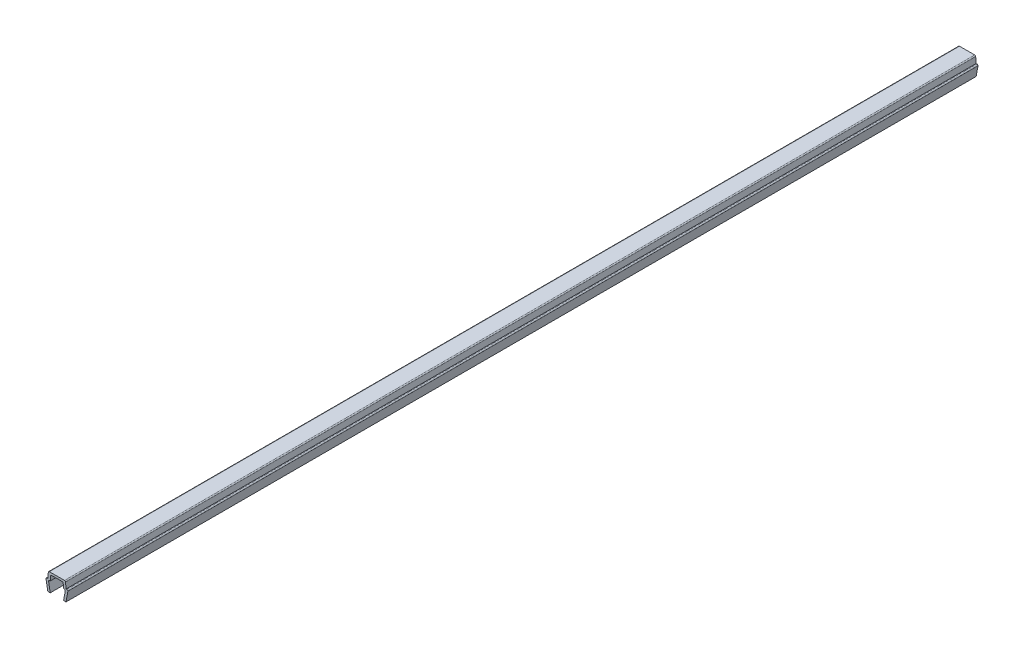
ISO-10303-21;
HEADER;
FILE_DESCRIPTION(('STEP AP214'),'2;1');
FILE_NAME('part.step','',(''),(''),'','','');
FILE_SCHEMA(('AUTOMOTIVE_DESIGN { 1 0 10303 214 1 1 1 1 }'));
ENDSEC;
DATA;
#1=APPLICATION_CONTEXT('core data for automotive mechanical design processes');
#2=APPLICATION_PROTOCOL_DEFINITION('international standard','automotive_design',2000,#1);
#3=PRODUCT_CONTEXT('',#1,'mechanical');
#4=PRODUCT('Part','Part','',(#3));
#5=PRODUCT_RELATED_PRODUCT_CATEGORY('part','',(#4));
#6=PRODUCT_DEFINITION_FORMATION('','',#4);
#7=PRODUCT_DEFINITION_CONTEXT('part definition',#1,'design');
#8=PRODUCT_DEFINITION('design','',#6,#7);
#9=PRODUCT_DEFINITION_SHAPE('','',#8);
#10=(LENGTH_UNIT() NAMED_UNIT(*) SI_UNIT(.MILLI.,.METRE.));
#11=(NAMED_UNIT(*) PLANE_ANGLE_UNIT() SI_UNIT($,.RADIAN.));
#12=(NAMED_UNIT(*) SI_UNIT($,.STERADIAN.) SOLID_ANGLE_UNIT());
#13=UNCERTAINTY_MEASURE_WITH_UNIT(LENGTH_MEASURE(1.E-05),#10,'distance_accuracy_value','');
#14=(GEOMETRIC_REPRESENTATION_CONTEXT(3) GLOBAL_UNCERTAINTY_ASSIGNED_CONTEXT((#13)) GLOBAL_UNIT_ASSIGNED_CONTEXT((#10,
#11,#12)) REPRESENTATION_CONTEXT('',''));
#15=CARTESIAN_POINT('',(0.,0.,0.));
#16=DIRECTION('',(0.,0.,1.));
#17=DIRECTION('',(1.,0.,0.));
#18=AXIS2_PLACEMENT_3D('',#15,#16,#17);
#19=CARTESIAN_POINT('',(-3.25000000000003,3.35000000000003,150.));
#20=DIRECTION('',(0.,0.,-1.));
#21=DIRECTION('',(-1.,0.,0.));
#22=AXIS2_PLACEMENT_3D('',#19,#20,#21);
#23=CYLINDRICAL_SURFACE('',#22,0.349999999999972);
#24=DIRECTION('',(0.,0.,-1.));
#25=VECTOR('',#24,1.);
#26=CARTESIAN_POINT('',(-3.25,3.7,150.));
#27=LINE('',#26,#25);
#28=CARTESIAN_POINT('',(-3.25,3.7,150.));
#29=VERTEX_POINT('',#28);
#30=CARTESIAN_POINT('',(-3.25,3.7,-150.));
#31=VERTEX_POINT('',#30);
#32=EDGE_CURVE('E211',#29,#31,#27,.T.);
#33=ORIENTED_EDGE('',*,*,#32,.T.);
#34=CARTESIAN_POINT('',(-3.25000000000003,3.35000000000003,-150.));
#35=DIRECTION('',(0.,0.,1.));
#36=DIRECTION('',(1.,0.,0.));
#37=AXIS2_PLACEMENT_3D('',#34,#35,#36);
#38=CIRCLE('',#37,0.349999999999972);
#39=CARTESIAN_POINT('',(-3.6,3.35,-150.));
#40=VERTEX_POINT('',#39);
#41=EDGE_CURVE('E205',#31,#40,#38,.T.);
#42=ORIENTED_EDGE('',*,*,#41,.T.);
#43=DIRECTION('',(0.,0.,-1.));
#44=VECTOR('',#43,1.);
#45=CARTESIAN_POINT('',(-3.6,3.35,150.));
#46=LINE('',#45,#44);
#47=CARTESIAN_POINT('',(-3.6,3.35,150.));
#48=VERTEX_POINT('',#47);
#49=EDGE_CURVE('E11',#48,#40,#46,.T.);
#50=ORIENTED_EDGE('',*,*,#49,.F.);
#51=CARTESIAN_POINT('',(-3.25000000000003,3.35000000000003,150.));
#52=DIRECTION('',(0.,0.,1.));
#53=DIRECTION('',(1.,0.,0.));
#54=AXIS2_PLACEMENT_3D('',#51,#52,#53);
#55=CIRCLE('',#54,0.349999999999972);
#56=EDGE_CURVE('E277',#29,#48,#55,.T.);
#57=ORIENTED_EDGE('',*,*,#56,.F.);
#58=EDGE_LOOP('',(#33,#42,#50,#57));
#59=FACE_BOUND('',#58,.T.);
#60=ADVANCED_FACE('F33',(#59),#23,.T.);
#61=CARTESIAN_POINT('',(-3.6,3.35,150.));
#62=DIRECTION('',(0.984336643247304,0.176299100283099,0.));
#63=DIRECTION('',(-0.176299100283099,0.984336643247304,0.));
#64=AXIS2_PLACEMENT_3D('',#61,#62,#63);
#65=PLANE('',#64);
#66=ORIENTED_EDGE('',*,*,#49,.T.);
#67=DIRECTION('',(0.176299100283099,-0.984336643247304,0.));
#68=VECTOR('',#67,1.);
#69=CARTESIAN_POINT('',(-3.6,3.35,-150.));
#70=LINE('',#69,#68);
#71=CARTESIAN_POINT('',(-3.,0.,-150.));
#72=VERTEX_POINT('',#71);
#73=EDGE_CURVE('E195',#40,#72,#70,.T.);
#74=ORIENTED_EDGE('',*,*,#73,.T.);
#75=DIRECTION('',(0.,0.,-1.));
#76=VECTOR('',#75,1.);
#77=CARTESIAN_POINT('',(-3.,0.,150.));
#78=LINE('',#77,#76);
#79=CARTESIAN_POINT('',(-3.,0.,150.));
#80=VERTEX_POINT('',#79);
#81=EDGE_CURVE('E40',#80,#72,#78,.T.);
#82=ORIENTED_EDGE('',*,*,#81,.F.);
#83=DIRECTION('',(0.176299100283099,-0.984336643247304,0.));
#84=VECTOR('',#83,1.);
#85=CARTESIAN_POINT('',(-3.6,3.35,150.));
#86=LINE('',#85,#84);
#87=EDGE_CURVE('E196',#48,#80,#86,.T.);
#88=ORIENTED_EDGE('',*,*,#87,.F.);
#89=EDGE_LOOP('',(#66,#74,#82,#88));
#90=FACE_BOUND('',#89,.T.);
#91=ADVANCED_FACE('F193',(#90),#65,.F.);
#92=CARTESIAN_POINT('',(-3.,0.,150.));
#93=DIRECTION('',(0.,1.,0.));
#94=DIRECTION('',(0.,0.,1.));
#95=AXIS2_PLACEMENT_3D('',#92,#93,#94);
#96=PLANE('',#95);
#97=ORIENTED_EDGE('',*,*,#81,.T.);
#98=DIRECTION('',(1.,0.,0.));
#99=VECTOR('',#98,1.);
#100=CARTESIAN_POINT('',(-3.,0.,-150.));
#101=LINE('',#100,#99);
#102=CARTESIAN_POINT('',(-2.2,0.,-150.));
#103=VERTEX_POINT('',#102);
#104=EDGE_CURVE('E209',#72,#103,#101,.T.);
#105=ORIENTED_EDGE('',*,*,#104,.T.);
#106=DIRECTION('',(0.,0.,-1.));
#107=VECTOR('',#106,1.);
#108=CARTESIAN_POINT('',(-2.2,0.,150.));
#109=LINE('',#108,#107);
#110=CARTESIAN_POINT('',(-2.2,0.,150.));
#111=VERTEX_POINT('',#110);
#112=EDGE_CURVE('E363',#111,#103,#109,.T.);
#113=ORIENTED_EDGE('',*,*,#112,.F.);
#114=DIRECTION('',(1.,0.,0.));
#115=VECTOR('',#114,1.);
#116=CARTESIAN_POINT('',(-3.,0.,150.));
#117=LINE('',#116,#115);
#118=EDGE_CURVE('E280',#80,#111,#117,.T.);
#119=ORIENTED_EDGE('',*,*,#118,.F.);
#120=EDGE_LOOP('',(#97,#105,#113,#119));
#121=FACE_BOUND('',#120,.T.);
#122=ADVANCED_FACE('F366',(#121),#96,.F.);
#123=CARTESIAN_POINT('',(-2.2,0.,150.));
#124=DIRECTION('',(-0.984336643247306,-0.176299100283088,0.));
#125=DIRECTION('',(0.176299100283088,-0.984336643247306,0.));
#126=AXIS2_PLACEMENT_3D('',#123,#124,#125);
#127=PLANE('',#126);
#128=ORIENTED_EDGE('',*,*,#112,.T.);
#129=DIRECTION('',(-0.176299100283088,0.984336643247306,0.));
#130=VECTOR('',#129,1.);
#131=CARTESIAN_POINT('',(-2.2,0.,-150.));
#132=LINE('',#131,#130);
#133=CARTESIAN_POINT('',(-2.7352170713255,2.9882953149009,-150.));
#134=VERTEX_POINT('',#133);
#135=EDGE_CURVE('E215',#103,#134,#132,.T.);
#136=ORIENTED_EDGE('',*,*,#135,.T.);
#137=DIRECTION('',(0.,0.,-1.));
#138=VECTOR('',#137,1.);
#139=CARTESIAN_POINT('',(-2.7352170713255,2.9882953149009,150.));
#140=LINE('',#139,#138);
#141=CARTESIAN_POINT('',(-2.7352170713255,2.9882953149009,150.));
#142=VERTEX_POINT('',#141);
#143=EDGE_CURVE('E361',#142,#134,#140,.T.);
#144=ORIENTED_EDGE('',*,*,#143,.F.);
#145=DIRECTION('',(-0.176299100283088,0.984336643247306,0.));
#146=VECTOR('',#145,1.);
#147=CARTESIAN_POINT('',(-2.2,0.,150.));
#148=LINE('',#147,#146);
#149=EDGE_CURVE('E282',#111,#142,#148,.T.);
#150=ORIENTED_EDGE('',*,*,#149,.F.);
#151=EDGE_LOOP('',(#128,#136,#144,#150));
#152=FACE_BOUND('',#151,.T.);
#153=ADVANCED_FACE('F374',(#152),#127,.F.);
#154=CARTESIAN_POINT('',(-2.390699246189,3.05000000000004,150.));
#155=DIRECTION('',(0.,0.,-1.));
#156=DIRECTION('',(-1.,0.,0.));
#157=AXIS2_PLACEMENT_3D('',#154,#155,#156);
#158=CYLINDRICAL_SURFACE('',#157,0.349999999999955);
#159=ORIENTED_EDGE('',*,*,#143,.T.);
#160=CARTESIAN_POINT('',(-2.390699246189,3.05000000000004,-150.));
#161=DIRECTION('',(0.,0.,-1.));
#162=DIRECTION('',(-1.,0.,0.));
#163=AXIS2_PLACEMENT_3D('',#160,#161,#162);
#164=CIRCLE('',#163,0.349999999999955);
#165=CARTESIAN_POINT('',(-2.390699246189,3.4,-150.));
#166=VERTEX_POINT('',#165);
#167=EDGE_CURVE('E218',#134,#166,#164,.T.);
#168=ORIENTED_EDGE('',*,*,#167,.T.);
#169=DIRECTION('',(0.,0.,-1.));
#170=VECTOR('',#169,1.);
#171=CARTESIAN_POINT('',(-2.390699246189,3.4,150.));
#172=LINE('',#171,#170);
#173=CARTESIAN_POINT('',(-2.390699246189,3.4,150.));
#174=VERTEX_POINT('',#173);
#175=EDGE_CURVE('E359',#174,#166,#172,.T.);
#176=ORIENTED_EDGE('',*,*,#175,.F.);
#177=CARTESIAN_POINT('',(-2.390699246189,3.05000000000004,150.));
#178=DIRECTION('',(0.,0.,-1.));
#179=DIRECTION('',(-1.,0.,0.));
#180=AXIS2_PLACEMENT_3D('',#177,#178,#179);
#181=CIRCLE('',#180,0.349999999999955);
#182=EDGE_CURVE('E284',#142,#174,#181,.T.);
#183=ORIENTED_EDGE('',*,*,#182,.F.);
#184=EDGE_LOOP('',(#159,#168,#176,#183));
#185=FACE_BOUND('',#184,.T.);
#186=ADVANCED_FACE('F377',(#185),#158,.F.);
#187=CARTESIAN_POINT('',(-2.390699246189,3.4,150.));
#188=DIRECTION('',(0.,1.,0.));
#189=DIRECTION('',(0.,0.,1.));
#190=AXIS2_PLACEMENT_3D('',#187,#188,#189);
#191=PLANE('',#190);
#192=ORIENTED_EDGE('',*,*,#175,.T.);
#193=DIRECTION('',(1.,0.,0.));
#194=VECTOR('',#193,1.);
#195=CARTESIAN_POINT('',(-2.390699246189,3.4,-150.));
#196=LINE('',#195,#194);
#197=CARTESIAN_POINT('',(-2.2,3.4,-150.));
#198=VERTEX_POINT('',#197);
#199=EDGE_CURVE('E221',#166,#198,#196,.T.);
#200=ORIENTED_EDGE('',*,*,#199,.T.);
#201=DIRECTION('',(0.,0.,-1.));
#202=VECTOR('',#201,1.);
#203=CARTESIAN_POINT('',(-2.2,3.4,150.));
#204=LINE('',#203,#202);
#205=CARTESIAN_POINT('',(-2.2,3.4,150.));
#206=VERTEX_POINT('',#205);
#207=EDGE_CURVE('E357',#206,#198,#204,.T.);
#208=ORIENTED_EDGE('',*,*,#207,.F.);
#209=DIRECTION('',(1.,0.,0.));
#210=VECTOR('',#209,1.);
#211=CARTESIAN_POINT('',(-2.390699246189,3.4,150.));
#212=LINE('',#211,#210);
#213=EDGE_CURVE('E286',#174,#206,#212,.T.);
#214=ORIENTED_EDGE('',*,*,#213,.F.);
#215=EDGE_LOOP('',(#192,#200,#208,#214));
#216=FACE_BOUND('',#215,.T.);
#217=ADVANCED_FACE('F382',(#216),#191,.F.);
#218=CARTESIAN_POINT('',(-2.2,3.4,150.));
#219=DIRECTION('',(-0.996194698091743,0.08715574274769,0.));
#220=DIRECTION('',(-0.08715574274769,-0.996194698091743,0.));
#221=AXIS2_PLACEMENT_3D('',#218,#219,#220);
#222=PLANE('',#221);
#223=ORIENTED_EDGE('',*,*,#207,.T.);
#224=DIRECTION('',(0.08715574274769,0.996194698091743,0.));
#225=VECTOR('',#224,1.);
#226=CARTESIAN_POINT('',(-2.2,3.4,-150.));
#227=LINE('',#226,#225);
#228=CARTESIAN_POINT('',(-2.0704726390793,4.8805045099617,-150.));
#229=VERTEX_POINT('',#228);
#230=EDGE_CURVE('E224',#198,#229,#227,.T.);
#231=ORIENTED_EDGE('',*,*,#230,.T.);
#232=DIRECTION('',(0.,0.,-1.));
#233=VECTOR('',#232,1.);
#234=CARTESIAN_POINT('',(-2.0704726390793,4.8805045099617,150.));
#235=LINE('',#234,#233);
#236=CARTESIAN_POINT('',(-2.0704726390793,4.8805045099617,150.));
#237=VERTEX_POINT('',#236);
#238=EDGE_CURVE('E355',#237,#229,#235,.T.);
#239=ORIENTED_EDGE('',*,*,#238,.F.);
#240=DIRECTION('',(0.08715574274769,0.996194698091743,0.));
#241=VECTOR('',#240,1.);
#242=CARTESIAN_POINT('',(-2.2,3.4,150.));
#243=LINE('',#242,#241);
#244=EDGE_CURVE('E288',#206,#237,#243,.T.);
#245=ORIENTED_EDGE('',*,*,#244,.F.);
#246=EDGE_LOOP('',(#223,#231,#239,#245));
#247=FACE_BOUND('',#246,.T.);
#248=ADVANCED_FACE('F388',(#247),#222,.F.);
#249=CARTESIAN_POINT('',(-1.72180449474716,4.84999999999996,150.));
#250=DIRECTION('',(0.,0.,-1.));
#251=DIRECTION('',(-1.,0.,0.));
#252=AXIS2_PLACEMENT_3D('',#249,#250,#251);
#253=CYLINDRICAL_SURFACE('',#252,0.350000000000036);
#254=ORIENTED_EDGE('',*,*,#238,.T.);
#255=CARTESIAN_POINT('',(-1.72180449474716,4.84999999999996,-150.));
#256=DIRECTION('',(0.,0.,-1.));
#257=DIRECTION('',(-1.,0.,0.));
#258=AXIS2_PLACEMENT_3D('',#255,#256,#257);
#259=CIRCLE('',#258,0.350000000000036);
#260=CARTESIAN_POINT('',(-1.7218044947472,5.2,-150.));
#261=VERTEX_POINT('',#260);
#262=EDGE_CURVE('E227',#229,#261,#259,.T.);
#263=ORIENTED_EDGE('',*,*,#262,.T.);
#264=DIRECTION('',(0.,0.,-1.));
#265=VECTOR('',#264,1.);
#266=CARTESIAN_POINT('',(-1.7218044947472,5.2,150.));
#267=LINE('',#266,#265);
#268=CARTESIAN_POINT('',(-1.7218044947472,5.2,150.));
#269=VERTEX_POINT('',#268);
#270=EDGE_CURVE('E353',#269,#261,#267,.T.);
#271=ORIENTED_EDGE('',*,*,#270,.F.);
#272=CARTESIAN_POINT('',(-1.72180449474716,4.84999999999996,150.));
#273=DIRECTION('',(0.,0.,-1.));
#274=DIRECTION('',(-1.,0.,0.));
#275=AXIS2_PLACEMENT_3D('',#272,#273,#274);
#276=CIRCLE('',#275,0.350000000000036);
#277=EDGE_CURVE('E290',#237,#269,#276,.T.);
#278=ORIENTED_EDGE('',*,*,#277,.F.);
#279=EDGE_LOOP('',(#254,#263,#271,#278));
#280=FACE_BOUND('',#279,.T.);
#281=ADVANCED_FACE('F392',(#280),#253,.F.);
#282=CARTESIAN_POINT('',(-1.7218044947472,5.2,150.));
#283=DIRECTION('',(0.,1.,0.));
#284=DIRECTION('',(0.,0.,1.));
#285=AXIS2_PLACEMENT_3D('',#282,#283,#284);
#286=PLANE('',#285);
#287=ORIENTED_EDGE('',*,*,#270,.T.);
#288=DIRECTION('',(1.,0.,0.));
#289=VECTOR('',#288,1.);
#290=CARTESIAN_POINT('',(-1.7218044947472,5.2,-150.));
#291=LINE('',#290,#289);
#292=CARTESIAN_POINT('',(1.7218044947472,5.2,-150.));
#293=VERTEX_POINT('',#292);
#294=EDGE_CURVE('E230',#261,#293,#291,.T.);
#295=ORIENTED_EDGE('',*,*,#294,.T.);
#296=DIRECTION('',(0.,0.,-1.));
#297=VECTOR('',#296,1.);
#298=CARTESIAN_POINT('',(1.7218044947472,5.2,150.));
#299=LINE('',#298,#297);
#300=CARTESIAN_POINT('',(1.7218044947472,5.2,150.));
#301=VERTEX_POINT('',#300);
#302=EDGE_CURVE('E351',#301,#293,#299,.T.);
#303=ORIENTED_EDGE('',*,*,#302,.F.);
#304=DIRECTION('',(1.,0.,0.));
#305=VECTOR('',#304,1.);
#306=CARTESIAN_POINT('',(-1.7218044947472,5.2,150.));
#307=LINE('',#306,#305);
#308=EDGE_CURVE('E292',#269,#301,#307,.T.);
#309=ORIENTED_EDGE('',*,*,#308,.F.);
#310=EDGE_LOOP('',(#287,#295,#303,#309));
#311=FACE_BOUND('',#310,.T.);
#312=ADVANCED_FACE('F397',(#311),#286,.F.);
#313=CARTESIAN_POINT('',(1.72180449474716,4.84999999999996,150.));
#314=DIRECTION('',(0.,0.,-1.));
#315=DIRECTION('',(-1.,0.,0.));
#316=AXIS2_PLACEMENT_3D('',#313,#314,#315);
#317=CYLINDRICAL_SURFACE('',#316,0.350000000000036);
#318=ORIENTED_EDGE('',*,*,#302,.T.);
#319=CARTESIAN_POINT('',(1.72180449474716,4.84999999999996,-150.));
#320=DIRECTION('',(0.,0.,-1.));
#321=DIRECTION('',(-1.,0.,0.));
#322=AXIS2_PLACEMENT_3D('',#319,#320,#321);
#323=CIRCLE('',#322,0.350000000000036);
#324=CARTESIAN_POINT('',(2.0704726390793,4.8805045099617,-150.));
#325=VERTEX_POINT('',#324);
#326=EDGE_CURVE('E233',#293,#325,#323,.T.);
#327=ORIENTED_EDGE('',*,*,#326,.T.);
#328=DIRECTION('',(0.,0.,-1.));
#329=VECTOR('',#328,1.);
#330=CARTESIAN_POINT('',(2.0704726390793,4.8805045099617,150.));
#331=LINE('',#330,#329);
#332=CARTESIAN_POINT('',(2.0704726390793,4.8805045099617,150.));
#333=VERTEX_POINT('',#332);
#334=EDGE_CURVE('E349',#333,#325,#331,.T.);
#335=ORIENTED_EDGE('',*,*,#334,.F.);
#336=CARTESIAN_POINT('',(1.72180449474716,4.84999999999996,150.));
#337=DIRECTION('',(0.,0.,-1.));
#338=DIRECTION('',(-1.,0.,0.));
#339=AXIS2_PLACEMENT_3D('',#336,#337,#338);
#340=CIRCLE('',#339,0.350000000000036);
#341=EDGE_CURVE('E294',#301,#333,#340,.T.);
#342=ORIENTED_EDGE('',*,*,#341,.F.);
#343=EDGE_LOOP('',(#318,#327,#335,#342));
#344=FACE_BOUND('',#343,.T.);
#345=ADVANCED_FACE('F403',(#344),#317,.F.);
#346=CARTESIAN_POINT('',(2.0704726390793,4.8805045099617,150.));
#347=DIRECTION('',(0.996194698091743,0.08715574274769,0.));
#348=DIRECTION('',(-0.08715574274769,0.996194698091743,0.));
#349=AXIS2_PLACEMENT_3D('',#346,#347,#348);
#350=PLANE('',#349);
#351=ORIENTED_EDGE('',*,*,#334,.T.);
#352=DIRECTION('',(0.08715574274769,-0.996194698091743,0.));
#353=VECTOR('',#352,1.);
#354=CARTESIAN_POINT('',(2.0704726390793,4.8805045099617,-150.));
#355=LINE('',#354,#353);
#356=CARTESIAN_POINT('',(2.2,3.4,-150.));
#357=VERTEX_POINT('',#356);
#358=EDGE_CURVE('E236',#325,#357,#355,.T.);
#359=ORIENTED_EDGE('',*,*,#358,.T.);
#360=DIRECTION('',(0.,0.,-1.));
#361=VECTOR('',#360,1.);
#362=CARTESIAN_POINT('',(2.2,3.4,150.));
#363=LINE('',#362,#361);
#364=CARTESIAN_POINT('',(2.2,3.4,150.));
#365=VERTEX_POINT('',#364);
#366=EDGE_CURVE('E347',#365,#357,#363,.T.);
#367=ORIENTED_EDGE('',*,*,#366,.F.);
#368=DIRECTION('',(0.08715574274769,-0.996194698091743,0.));
#369=VECTOR('',#368,1.);
#370=CARTESIAN_POINT('',(2.0704726390793,4.8805045099617,150.));
#371=LINE('',#370,#369);
#372=EDGE_CURVE('E296',#333,#365,#371,.T.);
#373=ORIENTED_EDGE('',*,*,#372,.F.);
#374=EDGE_LOOP('',(#351,#359,#367,#373));
#375=FACE_BOUND('',#374,.T.);
#376=ADVANCED_FACE('F407',(#375),#350,.F.);
#377=CARTESIAN_POINT('',(2.2,3.4,150.));
#378=DIRECTION('',(0.,1.,0.));
#379=DIRECTION('',(0.,0.,1.));
#380=AXIS2_PLACEMENT_3D('',#377,#378,#379);
#381=PLANE('',#380);
#382=ORIENTED_EDGE('',*,*,#366,.T.);
#383=DIRECTION('',(1.,0.,0.));
#384=VECTOR('',#383,1.);
#385=CARTESIAN_POINT('',(2.2,3.4,-150.));
#386=LINE('',#385,#384);
#387=CARTESIAN_POINT('',(2.390699246189,3.4,-150.));
#388=VERTEX_POINT('',#387);
#389=EDGE_CURVE('E239',#357,#388,#386,.T.);
#390=ORIENTED_EDGE('',*,*,#389,.T.);
#391=DIRECTION('',(0.,0.,-1.));
#392=VECTOR('',#391,1.);
#393=CARTESIAN_POINT('',(2.390699246189,3.4,150.));
#394=LINE('',#393,#392);
#395=CARTESIAN_POINT('',(2.390699246189,3.4,150.));
#396=VERTEX_POINT('',#395);
#397=EDGE_CURVE('E345',#396,#388,#394,.T.);
#398=ORIENTED_EDGE('',*,*,#397,.F.);
#399=DIRECTION('',(1.,0.,0.));
#400=VECTOR('',#399,1.);
#401=CARTESIAN_POINT('',(2.2,3.4,150.));
#402=LINE('',#401,#400);
#403=EDGE_CURVE('E298',#365,#396,#402,.T.);
#404=ORIENTED_EDGE('',*,*,#403,.F.);
#405=EDGE_LOOP('',(#382,#390,#398,#404));
#406=FACE_BOUND('',#405,.T.);
#407=ADVANCED_FACE('F412',(#406),#381,.F.);
#408=CARTESIAN_POINT('',(2.390699246189,3.05000000000004,150.));
#409=DIRECTION('',(0.,0.,-1.));
#410=DIRECTION('',(-1.,0.,0.));
#411=AXIS2_PLACEMENT_3D('',#408,#409,#410);
#412=CYLINDRICAL_SURFACE('',#411,0.349999999999955);
#413=ORIENTED_EDGE('',*,*,#397,.T.);
#414=CARTESIAN_POINT('',(2.390699246189,3.05000000000004,-150.));
#415=DIRECTION('',(0.,0.,-1.));
#416=DIRECTION('',(-1.,0.,0.));
#417=AXIS2_PLACEMENT_3D('',#414,#415,#416);
#418=CIRCLE('',#417,0.349999999999955);
#419=CARTESIAN_POINT('',(2.7352170713255,2.9882953149009,-150.));
#420=VERTEX_POINT('',#419);
#421=EDGE_CURVE('E242',#388,#420,#418,.T.);
#422=ORIENTED_EDGE('',*,*,#421,.T.);
#423=DIRECTION('',(0.,0.,-1.));
#424=VECTOR('',#423,1.);
#425=CARTESIAN_POINT('',(2.7352170713255,2.9882953149009,150.));
#426=LINE('',#425,#424);
#427=CARTESIAN_POINT('',(2.7352170713255,2.9882953149009,150.));
#428=VERTEX_POINT('',#427);
#429=EDGE_CURVE('E343',#428,#420,#426,.T.);
#430=ORIENTED_EDGE('',*,*,#429,.F.);
#431=CARTESIAN_POINT('',(2.390699246189,3.05000000000004,150.));
#432=DIRECTION('',(0.,0.,-1.));
#433=DIRECTION('',(-1.,0.,0.));
#434=AXIS2_PLACEMENT_3D('',#431,#432,#433);
#435=CIRCLE('',#434,0.349999999999955);
#436=EDGE_CURVE('E300',#396,#428,#435,.T.);
#437=ORIENTED_EDGE('',*,*,#436,.F.);
#438=EDGE_LOOP('',(#413,#422,#430,#437));
#439=FACE_BOUND('',#438,.T.);
#440=ADVANCED_FACE('F418',(#439),#412,.F.);
#441=CARTESIAN_POINT('',(2.7352170713255,2.9882953149009,150.));
#442=DIRECTION('',(0.984336643247306,-0.176299100283088,0.));
#443=DIRECTION('',(0.176299100283088,0.984336643247306,0.));
#444=AXIS2_PLACEMENT_3D('',#441,#442,#443);
#445=PLANE('',#444);
#446=ORIENTED_EDGE('',*,*,#429,.T.);
#447=DIRECTION('',(-0.176299100283088,-0.984336643247306,0.));
#448=VECTOR('',#447,1.);
#449=CARTESIAN_POINT('',(2.7352170713255,2.9882953149009,-150.));
#450=LINE('',#449,#448);
#451=CARTESIAN_POINT('',(2.2,0.,-150.));
#452=VERTEX_POINT('',#451);
#453=EDGE_CURVE('E245',#420,#452,#450,.T.);
#454=ORIENTED_EDGE('',*,*,#453,.T.);
#455=DIRECTION('',(0.,0.,-1.));
#456=VECTOR('',#455,1.);
#457=CARTESIAN_POINT('',(2.2,0.,150.));
#458=LINE('',#457,#456);
#459=CARTESIAN_POINT('',(2.2,0.,150.));
#460=VERTEX_POINT('',#459);
#461=EDGE_CURVE('E341',#460,#452,#458,.T.);
#462=ORIENTED_EDGE('',*,*,#461,.F.);
#463=DIRECTION('',(-0.176299100283088,-0.984336643247306,0.));
#464=VECTOR('',#463,1.);
#465=CARTESIAN_POINT('',(2.7352170713255,2.9882953149009,150.));
#466=LINE('',#465,#464);
#467=EDGE_CURVE('E302',#428,#460,#466,.T.);
#468=ORIENTED_EDGE('',*,*,#467,.F.);
#469=EDGE_LOOP('',(#446,#454,#462,#468));
#470=FACE_BOUND('',#469,.T.);
#471=ADVANCED_FACE('F422',(#470),#445,.F.);
#472=CARTESIAN_POINT('',(2.2,0.,150.));
#473=DIRECTION('',(0.,1.,0.));
#474=DIRECTION('',(0.,0.,1.));
#475=AXIS2_PLACEMENT_3D('',#472,#473,#474);
#476=PLANE('',#475);
#477=ORIENTED_EDGE('',*,*,#461,.T.);
#478=DIRECTION('',(1.,0.,0.));
#479=VECTOR('',#478,1.);
#480=CARTESIAN_POINT('',(2.2,0.,-150.));
#481=LINE('',#480,#479);
#482=CARTESIAN_POINT('',(3.,0.,-150.));
#483=VERTEX_POINT('',#482);
#484=EDGE_CURVE('E248',#452,#483,#481,.T.);
#485=ORIENTED_EDGE('',*,*,#484,.T.);
#486=DIRECTION('',(0.,0.,-1.));
#487=VECTOR('',#486,1.);
#488=CARTESIAN_POINT('',(3.,0.,150.));
#489=LINE('',#488,#487);
#490=CARTESIAN_POINT('',(3.,0.,150.));
#491=VERTEX_POINT('',#490);
#492=EDGE_CURVE('E339',#491,#483,#489,.T.);
#493=ORIENTED_EDGE('',*,*,#492,.F.);
#494=DIRECTION('',(1.,0.,0.));
#495=VECTOR('',#494,1.);
#496=CARTESIAN_POINT('',(2.2,0.,150.));
#497=LINE('',#496,#495);
#498=EDGE_CURVE('E304',#460,#491,#497,.T.);
#499=ORIENTED_EDGE('',*,*,#498,.F.);
#500=EDGE_LOOP('',(#477,#485,#493,#499));
#501=FACE_BOUND('',#500,.T.);
#502=ADVANCED_FACE('F427',(#501),#476,.F.);
#503=CARTESIAN_POINT('',(3.,0.,150.));
#504=DIRECTION('',(-0.984336643247304,0.176299100283099,0.));
#505=DIRECTION('',(-0.176299100283099,-0.984336643247304,0.));
#506=AXIS2_PLACEMENT_3D('',#503,#504,#505);
#507=PLANE('',#506);
#508=ORIENTED_EDGE('',*,*,#492,.T.);
#509=DIRECTION('',(0.176299100283099,0.984336643247304,0.));
#510=VECTOR('',#509,1.);
#511=CARTESIAN_POINT('',(3.,0.,-150.));
#512=LINE('',#511,#510);
#513=CARTESIAN_POINT('',(3.6,3.35,-150.));
#514=VERTEX_POINT('',#513);
#515=EDGE_CURVE('E251',#483,#514,#512,.T.);
#516=ORIENTED_EDGE('',*,*,#515,.T.);
#517=DIRECTION('',(0.,0.,-1.));
#518=VECTOR('',#517,1.);
#519=CARTESIAN_POINT('',(3.6,3.35,150.));
#520=LINE('',#519,#518);
#521=CARTESIAN_POINT('',(3.6,3.35,150.));
#522=VERTEX_POINT('',#521);
#523=EDGE_CURVE('E337',#522,#514,#520,.T.);
#524=ORIENTED_EDGE('',*,*,#523,.F.);
#525=DIRECTION('',(0.176299100283099,0.984336643247304,0.));
#526=VECTOR('',#525,1.);
#527=CARTESIAN_POINT('',(3.,0.,150.));
#528=LINE('',#527,#526);
#529=EDGE_CURVE('E306',#491,#522,#528,.T.);
#530=ORIENTED_EDGE('',*,*,#529,.F.);
#531=EDGE_LOOP('',(#508,#516,#524,#530));
#532=FACE_BOUND('',#531,.T.);
#533=ADVANCED_FACE('F433',(#532),#507,.F.);
#534=CARTESIAN_POINT('',(3.25000000000003,3.35000000000003,150.));
#535=DIRECTION('',(0.,0.,-1.));
#536=DIRECTION('',(-1.,0.,0.));
#537=AXIS2_PLACEMENT_3D('',#534,#535,#536);
#538=CYLINDRICAL_SURFACE('',#537,0.349999999999972);
#539=ORIENTED_EDGE('',*,*,#523,.T.);
#540=CARTESIAN_POINT('',(3.25000000000003,3.35000000000003,-150.));
#541=DIRECTION('',(0.,0.,1.));
#542=DIRECTION('',(1.,0.,0.));
#543=AXIS2_PLACEMENT_3D('',#540,#541,#542);
#544=CIRCLE('',#543,0.349999999999972);
#545=CARTESIAN_POINT('',(3.25,3.7,-150.));
#546=VERTEX_POINT('',#545);
#547=EDGE_CURVE('E254',#514,#546,#544,.T.);
#548=ORIENTED_EDGE('',*,*,#547,.T.);
#549=DIRECTION('',(0.,0.,-1.));
#550=VECTOR('',#549,1.);
#551=CARTESIAN_POINT('',(3.25,3.7,150.));
#552=LINE('',#551,#550);
#553=CARTESIAN_POINT('',(3.25,3.7,150.));
#554=VERTEX_POINT('',#553);
#555=EDGE_CURVE('E335',#554,#546,#552,.T.);
#556=ORIENTED_EDGE('',*,*,#555,.F.);
#557=CARTESIAN_POINT('',(3.25000000000003,3.35000000000003,150.));
#558=DIRECTION('',(0.,0.,1.));
#559=DIRECTION('',(1.,0.,0.));
#560=AXIS2_PLACEMENT_3D('',#557,#558,#559);
#561=CIRCLE('',#560,0.349999999999972);
#562=EDGE_CURVE('E308',#522,#554,#561,.T.);
#563=ORIENTED_EDGE('',*,*,#562,.F.);
#564=EDGE_LOOP('',(#539,#548,#556,#563));
#565=FACE_BOUND('',#564,.T.);
#566=ADVANCED_FACE('F437',(#565),#538,.T.);
#567=CARTESIAN_POINT('',(3.25,3.7,150.));
#568=DIRECTION('',(0.,-1.,0.));
#569=DIRECTION('',(0.,0.,-1.));
#570=AXIS2_PLACEMENT_3D('',#567,#568,#569);
#571=PLANE('',#570);
#572=ORIENTED_EDGE('',*,*,#555,.T.);
#573=DIRECTION('',(-1.,0.,0.));
#574=VECTOR('',#573,1.);
#575=CARTESIAN_POINT('',(3.25,3.7,-150.));
#576=LINE('',#575,#574);
#577=CARTESIAN_POINT('',(3.,3.7,-150.));
#578=VERTEX_POINT('',#577);
#579=EDGE_CURVE('E257',#546,#578,#576,.T.);
#580=ORIENTED_EDGE('',*,*,#579,.T.);
#581=DIRECTION('',(0.,0.,-1.));
#582=VECTOR('',#581,1.);
#583=CARTESIAN_POINT('',(3.,3.7,150.));
#584=LINE('',#583,#582);
#585=CARTESIAN_POINT('',(3.,3.7,150.));
#586=VERTEX_POINT('',#585);
#587=EDGE_CURVE('E333',#586,#578,#584,.T.);
#588=ORIENTED_EDGE('',*,*,#587,.F.);
#589=DIRECTION('',(-1.,0.,0.));
#590=VECTOR('',#589,1.);
#591=CARTESIAN_POINT('',(3.25,3.7,150.));
#592=LINE('',#591,#590);
#593=EDGE_CURVE('E310',#554,#586,#592,.T.);
#594=ORIENTED_EDGE('',*,*,#593,.F.);
#595=EDGE_LOOP('',(#572,#580,#588,#594));
#596=FACE_BOUND('',#595,.T.);
#597=ADVANCED_FACE('F442',(#596),#571,.F.);
#598=CARTESIAN_POINT('',(3.,3.7,150.));
#599=DIRECTION('',(-0.996194698091747,-0.0871557427476467,0.));
#600=DIRECTION('',(0.0871557427476467,-0.996194698091747,0.));
#601=AXIS2_PLACEMENT_3D('',#598,#599,#600);
#602=PLANE('',#601);
#603=ORIENTED_EDGE('',*,*,#587,.T.);
#604=DIRECTION('',(-0.0871557427476467,0.996194698091747,0.));
#605=VECTOR('',#604,1.);
#606=CARTESIAN_POINT('',(3.,3.7,-150.));
#607=LINE('',#606,#605);
#608=CARTESIAN_POINT('',(2.835477173669,5.5805045099617,-150.));
#609=VERTEX_POINT('',#608);
#610=EDGE_CURVE('E260',#578,#609,#607,.T.);
#611=ORIENTED_EDGE('',*,*,#610,.T.);
#612=DIRECTION('',(0.,0.,-1.));
#613=VECTOR('',#612,1.);
#614=CARTESIAN_POINT('',(2.835477173669,5.5805045099617,150.));
#615=LINE('',#614,#613);
#616=CARTESIAN_POINT('',(2.835477173669,5.5805045099617,150.));
#617=VERTEX_POINT('',#616);
#618=EDGE_CURVE('E331',#617,#609,#615,.T.);
#619=ORIENTED_EDGE('',*,*,#618,.F.);
#620=DIRECTION('',(-0.0871557427476467,0.996194698091747,0.));
#621=VECTOR('',#620,1.);
#622=CARTESIAN_POINT('',(3.,3.7,150.));
#623=LINE('',#622,#621);
#624=EDGE_CURVE('E312',#586,#617,#623,.T.);
#625=ORIENTED_EDGE('',*,*,#624,.F.);
#626=EDGE_LOOP('',(#603,#611,#619,#625));
#627=FACE_BOUND('',#626,.T.);
#628=ADVANCED_FACE('F448',(#627),#602,.F.);
#629=CARTESIAN_POINT('',(2.48680902933686,5.54999999999996,150.));
#630=DIRECTION('',(0.,0.,-1.));
#631=DIRECTION('',(-1.,0.,0.));
#632=AXIS2_PLACEMENT_3D('',#629,#630,#631);
#633=CYLINDRICAL_SURFACE('',#632,0.350000000000036);
#634=ORIENTED_EDGE('',*,*,#618,.T.);
#635=CARTESIAN_POINT('',(2.48680902933686,5.54999999999996,-150.));
#636=DIRECTION('',(0.,0.,1.));
#637=DIRECTION('',(1.,0.,0.));
#638=AXIS2_PLACEMENT_3D('',#635,#636,#637);
#639=CIRCLE('',#638,0.350000000000036);
#640=CARTESIAN_POINT('',(2.4868090293369,5.9,-150.));
#641=VERTEX_POINT('',#640);
#642=EDGE_CURVE('E263',#609,#641,#639,.T.);
#643=ORIENTED_EDGE('',*,*,#642,.T.);
#644=DIRECTION('',(0.,0.,-1.));
#645=VECTOR('',#644,1.);
#646=CARTESIAN_POINT('',(2.4868090293369,5.9,150.));
#647=LINE('',#646,#645);
#648=CARTESIAN_POINT('',(2.4868090293369,5.9,150.));
#649=VERTEX_POINT('',#648);
#650=EDGE_CURVE('E329',#649,#641,#647,.T.);
#651=ORIENTED_EDGE('',*,*,#650,.F.);
#652=CARTESIAN_POINT('',(2.48680902933686,5.54999999999996,150.));
#653=DIRECTION('',(0.,0.,1.));
#654=DIRECTION('',(1.,0.,0.));
#655=AXIS2_PLACEMENT_3D('',#652,#653,#654);
#656=CIRCLE('',#655,0.350000000000036);
#657=EDGE_CURVE('E314',#617,#649,#656,.T.);
#658=ORIENTED_EDGE('',*,*,#657,.F.);
#659=EDGE_LOOP('',(#634,#643,#651,#658));
#660=FACE_BOUND('',#659,.T.);
#661=ADVANCED_FACE('F452',(#660),#633,.T.);
#662=CARTESIAN_POINT('',(2.4868090293369,5.9,150.));
#663=DIRECTION('',(0.,-1.,0.));
#664=DIRECTION('',(0.,0.,-1.));
#665=AXIS2_PLACEMENT_3D('',#662,#663,#664);
#666=PLANE('',#665);
#667=ORIENTED_EDGE('',*,*,#650,.T.);
#668=DIRECTION('',(-1.,0.,0.));
#669=VECTOR('',#668,1.);
#670=CARTESIAN_POINT('',(2.4868090293369,5.9,-150.));
#671=LINE('',#670,#669);
#672=CARTESIAN_POINT('',(-2.4868090293369,5.9,-150.));
#673=VERTEX_POINT('',#672);
#674=EDGE_CURVE('E266',#641,#673,#671,.T.);
#675=ORIENTED_EDGE('',*,*,#674,.T.);
#676=DIRECTION('',(0.,0.,-1.));
#677=VECTOR('',#676,1.);
#678=CARTESIAN_POINT('',(-2.4868090293369,5.9,150.));
#679=LINE('',#678,#677);
#680=CARTESIAN_POINT('',(-2.4868090293369,5.9,150.));
#681=VERTEX_POINT('',#680);
#682=EDGE_CURVE('E327',#681,#673,#679,.T.);
#683=ORIENTED_EDGE('',*,*,#682,.F.);
#684=DIRECTION('',(-1.,0.,0.));
#685=VECTOR('',#684,1.);
#686=CARTESIAN_POINT('',(2.4868090293369,5.9,150.));
#687=LINE('',#686,#685);
#688=EDGE_CURVE('E316',#649,#681,#687,.T.);
#689=ORIENTED_EDGE('',*,*,#688,.F.);
#690=EDGE_LOOP('',(#667,#675,#683,#689));
#691=FACE_BOUND('',#690,.T.);
#692=ADVANCED_FACE('F457',(#691),#666,.F.);
#693=CARTESIAN_POINT('',(-2.48680902933686,5.54999999999996,150.));
#694=DIRECTION('',(0.,0.,-1.));
#695=DIRECTION('',(-1.,0.,0.));
#696=AXIS2_PLACEMENT_3D('',#693,#694,#695);
#697=CYLINDRICAL_SURFACE('',#696,0.350000000000036);
#698=ORIENTED_EDGE('',*,*,#682,.T.);
#699=CARTESIAN_POINT('',(-2.48680902933686,5.54999999999996,-150.));
#700=DIRECTION('',(0.,0.,1.));
#701=DIRECTION('',(1.,0.,0.));
#702=AXIS2_PLACEMENT_3D('',#699,#700,#701);
#703=CIRCLE('',#702,0.350000000000036);
#704=CARTESIAN_POINT('',(-2.835477173669,5.5805045099617,-150.));
#705=VERTEX_POINT('',#704);
#706=EDGE_CURVE('E269',#673,#705,#703,.T.);
#707=ORIENTED_EDGE('',*,*,#706,.T.);
#708=DIRECTION('',(0.,0.,-1.));
#709=VECTOR('',#708,1.);
#710=CARTESIAN_POINT('',(-2.835477173669,5.5805045099617,150.));
#711=LINE('',#710,#709);
#712=CARTESIAN_POINT('',(-2.835477173669,5.5805045099617,150.));
#713=VERTEX_POINT('',#712);
#714=EDGE_CURVE('E325',#713,#705,#711,.T.);
#715=ORIENTED_EDGE('',*,*,#714,.F.);
#716=CARTESIAN_POINT('',(-2.48680902933686,5.54999999999996,150.));
#717=DIRECTION('',(0.,0.,1.));
#718=DIRECTION('',(1.,0.,0.));
#719=AXIS2_PLACEMENT_3D('',#716,#717,#718);
#720=CIRCLE('',#719,0.350000000000036);
#721=EDGE_CURVE('E318',#681,#713,#720,.T.);
#722=ORIENTED_EDGE('',*,*,#721,.F.);
#723=EDGE_LOOP('',(#698,#707,#715,#722));
#724=FACE_BOUND('',#723,.T.);
#725=ADVANCED_FACE('F461',(#724),#697,.T.);
#726=CARTESIAN_POINT('',(-2.835477173669,5.5805045099617,150.));
#727=DIRECTION('',(0.996194698091747,-0.0871557427476467,0.));
#728=DIRECTION('',(0.0871557427476467,0.996194698091747,0.));
#729=AXIS2_PLACEMENT_3D('',#726,#727,#728);
#730=PLANE('',#729);
#731=ORIENTED_EDGE('',*,*,#714,.T.);
#732=DIRECTION('',(-0.0871557427476467,-0.996194698091747,0.));
#733=VECTOR('',#732,1.);
#734=CARTESIAN_POINT('',(-2.835477173669,5.5805045099617,-150.));
#735=LINE('',#734,#733);
#736=CARTESIAN_POINT('',(-3.,3.7,-150.));
#737=VERTEX_POINT('',#736);
#738=EDGE_CURVE('E272',#705,#737,#735,.T.);
#739=ORIENTED_EDGE('',*,*,#738,.T.);
#740=DIRECTION('',(0.,0.,-1.));
#741=VECTOR('',#740,1.);
#742=CARTESIAN_POINT('',(-3.,3.7,150.));
#743=LINE('',#742,#741);
#744=CARTESIAN_POINT('',(-3.,3.7,150.));
#745=VERTEX_POINT('',#744);
#746=EDGE_CURVE('E323',#745,#737,#743,.T.);
#747=ORIENTED_EDGE('',*,*,#746,.F.);
#748=DIRECTION('',(-0.0871557427476467,-0.996194698091747,0.));
#749=VECTOR('',#748,1.);
#750=CARTESIAN_POINT('',(-2.835477173669,5.5805045099617,150.));
#751=LINE('',#750,#749);
#752=EDGE_CURVE('E52',#713,#745,#751,.T.);
#753=ORIENTED_EDGE('',*,*,#752,.F.);
#754=EDGE_LOOP('',(#731,#739,#747,#753));
#755=FACE_BOUND('',#754,.T.);
#756=ADVANCED_FACE('F465',(#755),#730,.F.);
#757=CARTESIAN_POINT('',(-3.,3.7,150.));
#758=DIRECTION('',(0.,-1.,0.));
#759=DIRECTION('',(0.,0.,-1.));
#760=AXIS2_PLACEMENT_3D('',#757,#758,#759);
#761=PLANE('',#760);
#762=ORIENTED_EDGE('',*,*,#746,.T.);
#763=DIRECTION('',(-1.,0.,0.));
#764=VECTOR('',#763,1.);
#765=CARTESIAN_POINT('',(-3.,3.7,-150.));
#766=LINE('',#765,#764);
#767=EDGE_CURVE('E275',#737,#31,#766,.T.);
#768=ORIENTED_EDGE('',*,*,#767,.T.);
#769=ORIENTED_EDGE('',*,*,#32,.F.);
#770=DIRECTION('',(-1.,0.,0.));
#771=VECTOR('',#770,1.);
#772=CARTESIAN_POINT('',(-3.,3.7,150.));
#773=LINE('',#772,#771);
#774=EDGE_CURVE('E47',#745,#29,#773,.T.);
#775=ORIENTED_EDGE('',*,*,#774,.F.);
#776=EDGE_LOOP('',(#762,#768,#769,#775));
#777=FACE_BOUND('',#776,.T.);
#778=ADVANCED_FACE('F467',(#777),#761,.F.);
#779=CARTESIAN_POINT('',(-3.25000000000003,3.35000000000003,150.));
#780=DIRECTION('',(0.,0.,1.));
#781=DIRECTION('',(1.,0.,0.));
#782=AXIS2_PLACEMENT_3D('',#779,#780,#781);
#783=PLANE('',#782);
#784=ORIENTED_EDGE('',*,*,#56,.T.);
#785=ORIENTED_EDGE('',*,*,#87,.T.);
#786=ORIENTED_EDGE('',*,*,#118,.T.);
#787=ORIENTED_EDGE('',*,*,#149,.T.);
#788=ORIENTED_EDGE('',*,*,#182,.T.);
#789=ORIENTED_EDGE('',*,*,#213,.T.);
#790=ORIENTED_EDGE('',*,*,#244,.T.);
#791=ORIENTED_EDGE('',*,*,#277,.T.);
#792=ORIENTED_EDGE('',*,*,#308,.T.);
#793=ORIENTED_EDGE('',*,*,#341,.T.);
#794=ORIENTED_EDGE('',*,*,#372,.T.);
#795=ORIENTED_EDGE('',*,*,#403,.T.);
#796=ORIENTED_EDGE('',*,*,#436,.T.);
#797=ORIENTED_EDGE('',*,*,#467,.T.);
#798=ORIENTED_EDGE('',*,*,#498,.T.);
#799=ORIENTED_EDGE('',*,*,#529,.T.);
#800=ORIENTED_EDGE('',*,*,#562,.T.);
#801=ORIENTED_EDGE('',*,*,#593,.T.);
#802=ORIENTED_EDGE('',*,*,#624,.T.);
#803=ORIENTED_EDGE('',*,*,#657,.T.);
#804=ORIENTED_EDGE('',*,*,#688,.T.);
#805=ORIENTED_EDGE('',*,*,#721,.T.);
#806=ORIENTED_EDGE('',*,*,#752,.T.);
#807=ORIENTED_EDGE('',*,*,#774,.T.);
#808=EDGE_LOOP('',(#784,#785,#786,#787,#788,#789,#790,#791,#792,#793,#794,#795,#796,#797,#798,
#799,#800,#801,#802,#803,#804,#805,#806,#807));
#809=FACE_BOUND('',#808,.T.);
#810=ADVANCED_FACE('F369',(#809),#783,.T.);
#811=CARTESIAN_POINT('',(-3.25000000000003,3.35000000000003,-150.));
#812=DIRECTION('',(0.,0.,1.));
#813=DIRECTION('',(1.,0.,0.));
#814=AXIS2_PLACEMENT_3D('',#811,#812,#813);
#815=PLANE('',#814);
#816=ORIENTED_EDGE('',*,*,#41,.F.);
#817=ORIENTED_EDGE('',*,*,#767,.F.);
#818=ORIENTED_EDGE('',*,*,#738,.F.);
#819=ORIENTED_EDGE('',*,*,#706,.F.);
#820=ORIENTED_EDGE('',*,*,#674,.F.);
#821=ORIENTED_EDGE('',*,*,#642,.F.);
#822=ORIENTED_EDGE('',*,*,#610,.F.);
#823=ORIENTED_EDGE('',*,*,#579,.F.);
#824=ORIENTED_EDGE('',*,*,#547,.F.);
#825=ORIENTED_EDGE('',*,*,#515,.F.);
#826=ORIENTED_EDGE('',*,*,#484,.F.);
#827=ORIENTED_EDGE('',*,*,#453,.F.);
#828=ORIENTED_EDGE('',*,*,#421,.F.);
#829=ORIENTED_EDGE('',*,*,#389,.F.);
#830=ORIENTED_EDGE('',*,*,#358,.F.);
#831=ORIENTED_EDGE('',*,*,#326,.F.);
#832=ORIENTED_EDGE('',*,*,#294,.F.);
#833=ORIENTED_EDGE('',*,*,#262,.F.);
#834=ORIENTED_EDGE('',*,*,#230,.F.);
#835=ORIENTED_EDGE('',*,*,#199,.F.);
#836=ORIENTED_EDGE('',*,*,#167,.F.);
#837=ORIENTED_EDGE('',*,*,#135,.F.);
#838=ORIENTED_EDGE('',*,*,#104,.F.);
#839=ORIENTED_EDGE('',*,*,#73,.F.);
#840=EDGE_LOOP('',(#816,#817,#818,#819,#820,#821,#822,#823,#824,#825,#826,#827,#828,#829,#830,
#831,#832,#833,#834,#835,#836,#837,#838,#839));
#841=FACE_BOUND('',#840,.T.);
#842=ADVANCED_FACE('F203',(#841),#815,.F.);
#843=CLOSED_SHELL('',(#60,#91,#122,#153,#186,#217,#248,#281,#312,#345,#376,#407,#440,#471,#502,
#533,#566,#597,#628,#661,#692,#725,#756,#778,#810,#842));
#844=MANIFOLD_SOLID_BREP('B2',#843);
#845=ADVANCED_BREP_SHAPE_REPRESENTATION('',(#18,#844),#14);
#846=SHAPE_DEFINITION_REPRESENTATION(#9,#845);
ENDSEC;
END-ISO-10303-21;
